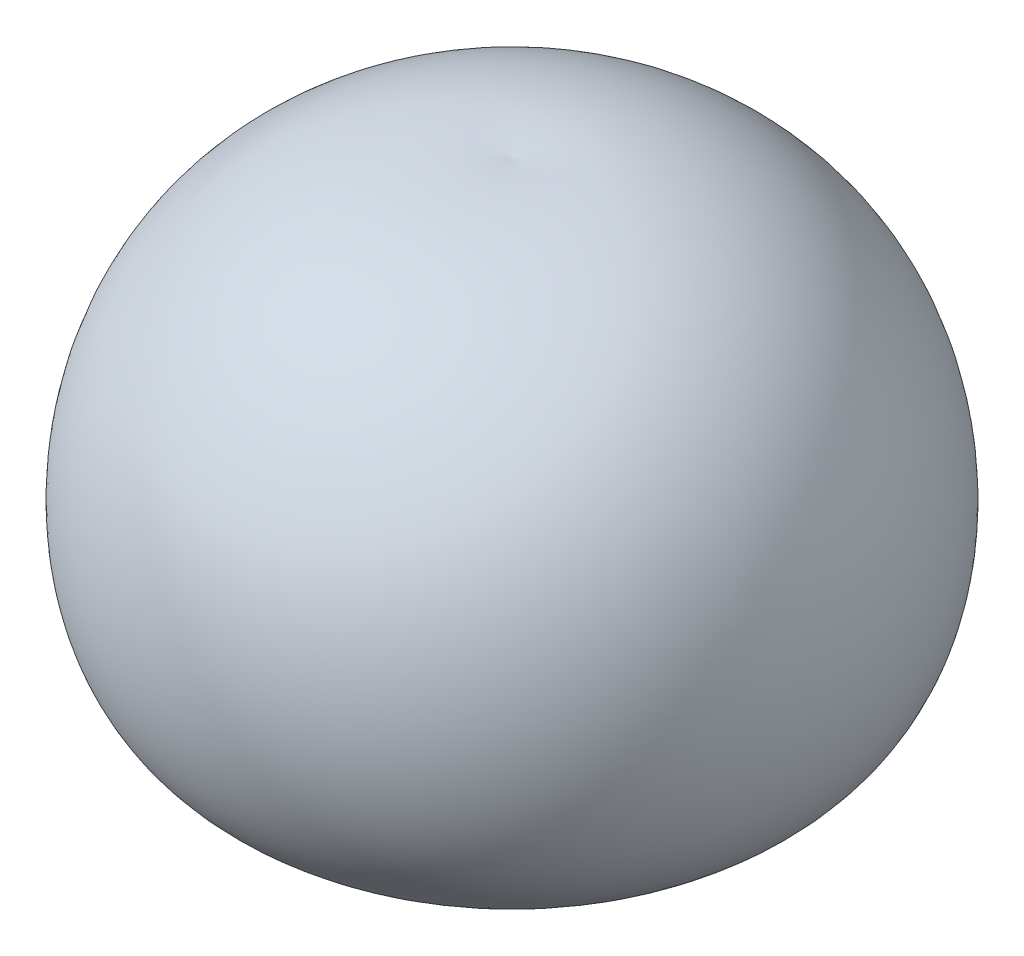
ISO-10303-21;
HEADER;
FILE_DESCRIPTION(('STEP AP214'),'2;1');
FILE_NAME('part.step','',(''),(''),'','','');
FILE_SCHEMA(('AUTOMOTIVE_DESIGN { 1 0 10303 214 1 1 1 1 }'));
ENDSEC;
DATA;
#1=APPLICATION_CONTEXT('core data for automotive mechanical design processes');
#2=APPLICATION_PROTOCOL_DEFINITION('international standard','automotive_design',2000,#1);
#3=PRODUCT_CONTEXT('',#1,'mechanical');
#4=PRODUCT('Part','Part','',(#3));
#5=PRODUCT_RELATED_PRODUCT_CATEGORY('part','',(#4));
#6=PRODUCT_DEFINITION_FORMATION('','',#4);
#7=PRODUCT_DEFINITION_CONTEXT('part definition',#1,'design');
#8=PRODUCT_DEFINITION('design','',#6,#7);
#9=PRODUCT_DEFINITION_SHAPE('','',#8);
#10=(LENGTH_UNIT() NAMED_UNIT(*) SI_UNIT(.MILLI.,.METRE.));
#11=(NAMED_UNIT(*) PLANE_ANGLE_UNIT() SI_UNIT($,.RADIAN.));
#12=(NAMED_UNIT(*) SI_UNIT($,.STERADIAN.) SOLID_ANGLE_UNIT());
#13=UNCERTAINTY_MEASURE_WITH_UNIT(LENGTH_MEASURE(1.E-05),#10,'distance_accuracy_value','');
#14=(GEOMETRIC_REPRESENTATION_CONTEXT(3) GLOBAL_UNCERTAINTY_ASSIGNED_CONTEXT((#13)) GLOBAL_UNIT_ASSIGNED_CONTEXT((#10,
#11,#12)) REPRESENTATION_CONTEXT('',''));
#15=CARTESIAN_POINT('',(0.,0.,0.));
#16=DIRECTION('',(0.,0.,1.));
#17=DIRECTION('',(1.,0.,0.));
#18=AXIS2_PLACEMENT_3D('',#15,#16,#17);
#19=CARTESIAN_POINT('',(0.,0.,0.));
#20=CARTESIAN_POINT('',(9.36372744281973,-1.02995756608084,0.));
#21=CARTESIAN_POINT('',(35.3279559244678,2.43093450193395,0.));
#22=CARTESIAN_POINT('',(37.8238288677911,44.0730124372446,0.));
#23=CARTESIAN_POINT('',(15.9995747488615,58.8336561212789,0.));
#24=CARTESIAN_POINT('',(0.,57.,0.));
#25=B_SPLINE_CURVE_WITH_KNOTS('',3,(#19,#20,#21,#22,#23,#24),.UNSPECIFIED.,.F.,.F.,(4,1,1,4),
(0.,0.320082548403654,0.582991776440328,1.),.UNSPECIFIED.);
#26=CARTESIAN_POINT('',(0.,0.,0.));
#27=DIRECTION('',(0.,-1.,0.));
#28=AXIS1_PLACEMENT('',#26,#27);
#29=SURFACE_OF_REVOLUTION('',#25,#28);
#30=CARTESIAN_POINT('',(0.,57.,0.));
#31=VERTEX_POINT('',#30);
#32=VERTEX_LOOP('',#31);
#33=FACE_BOUND('',#32,.T.);
#34=CARTESIAN_POINT('',(0.,0.,0.));
#35=VERTEX_POINT('',#34);
#36=VERTEX_LOOP('',#35);
#37=FACE_BOUND('',#36,.T.);
#38=ADVANCED_FACE('F38',(#33,#37),#29,.F.);
#39=CLOSED_SHELL('',(#38));
#40=MANIFOLD_SOLID_BREP('B2',#39);
#41=ADVANCED_BREP_SHAPE_REPRESENTATION('',(#18,#40),#14);
#42=SHAPE_DEFINITION_REPRESENTATION(#9,#41);
ENDSEC;
END-ISO-10303-21;
